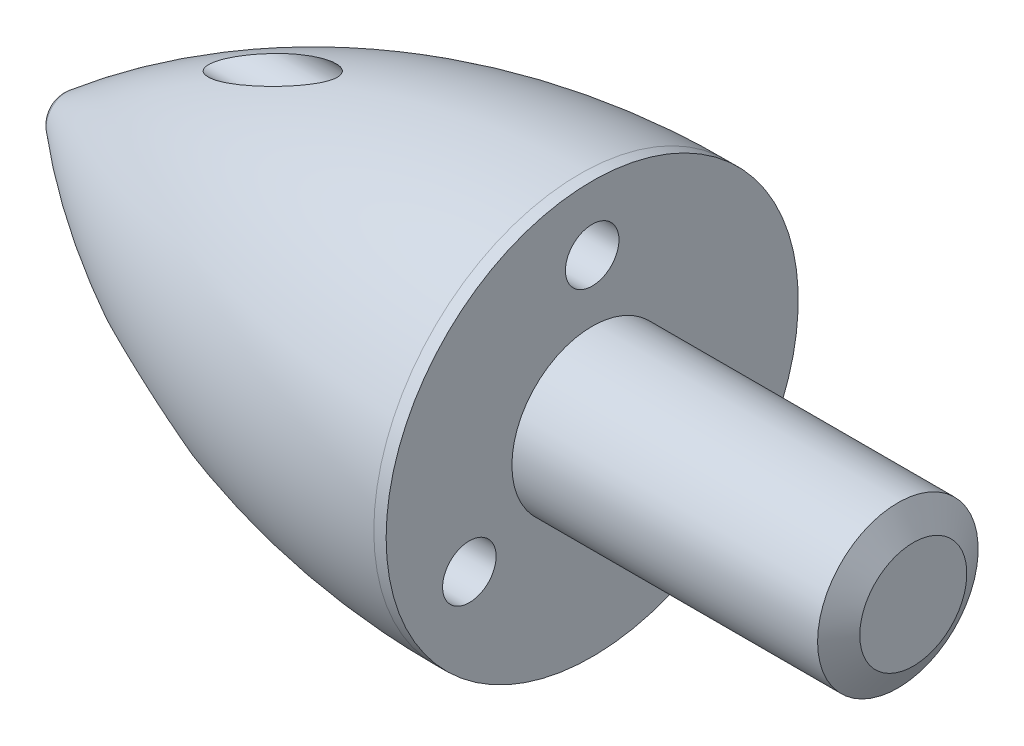
ISO-10303-21;
HEADER;
FILE_DESCRIPTION(('STEP AP214'),'2;1');
FILE_NAME('part.step','',(''),(''),'','','');
FILE_SCHEMA(('AUTOMOTIVE_DESIGN { 1 0 10303 214 1 1 1 1 }'));
ENDSEC;
DATA;
#1=APPLICATION_CONTEXT('core data for automotive mechanical design processes');
#2=APPLICATION_PROTOCOL_DEFINITION('international standard','automotive_design',2000,#1);
#3=PRODUCT_CONTEXT('',#1,'mechanical');
#4=PRODUCT('Part','Part','',(#3));
#5=PRODUCT_RELATED_PRODUCT_CATEGORY('part','',(#4));
#6=PRODUCT_DEFINITION_FORMATION('','',#4);
#7=PRODUCT_DEFINITION_CONTEXT('part definition',#1,'design');
#8=PRODUCT_DEFINITION('design','',#6,#7);
#9=PRODUCT_DEFINITION_SHAPE('','',#8);
#10=(LENGTH_UNIT() NAMED_UNIT(*) SI_UNIT(.MILLI.,.METRE.));
#11=(NAMED_UNIT(*) PLANE_ANGLE_UNIT() SI_UNIT($,.RADIAN.));
#12=(NAMED_UNIT(*) SI_UNIT($,.STERADIAN.) SOLID_ANGLE_UNIT());
#13=UNCERTAINTY_MEASURE_WITH_UNIT(LENGTH_MEASURE(1.E-05),#10,'distance_accuracy_value','');
#14=(GEOMETRIC_REPRESENTATION_CONTEXT(3) GLOBAL_UNCERTAINTY_ASSIGNED_CONTEXT((#13)) GLOBAL_UNIT_ASSIGNED_CONTEXT((#10,
#11,#12)) REPRESENTATION_CONTEXT('',''));
#15=CARTESIAN_POINT('',(0.,0.,0.));
#16=DIRECTION('',(0.,0.,1.));
#17=DIRECTION('',(1.,0.,0.));
#18=AXIS2_PLACEMENT_3D('',#15,#16,#17);
#19=CARTESIAN_POINT('',(-88.99,0.,0.));
#20=DIRECTION('',(-1.,0.,0.));
#21=DIRECTION('',(0.,0.,1.));
#22=AXIS2_PLACEMENT_3D('',#19,#20,#21);
#23=CYLINDRICAL_SURFACE('',#22,3.85);
#24=CARTESIAN_POINT('',(-0.230291266711771,0.,0.));
#25=DIRECTION('',(-1.,0.,0.));
#26=DIRECTION('',(0.,0.,1.));
#27=AXIS2_PLACEMENT_3D('',#24,#25,#26);
#28=CIRCLE('',#27,3.85);
#29=CARTESIAN_POINT('',(-0.230291266711771,0.,3.85));
#30=VERTEX_POINT('',#29);
#31=EDGE_CURVE('E71',#30,#30,#28,.T.);
#32=ORIENTED_EDGE('',*,*,#31,.F.);
#33=EDGE_LOOP('',(#32));
#34=FACE_BOUND('',#33,.T.);
#35=CARTESIAN_POINT('',(0.,0.,0.));
#36=DIRECTION('',(-1.,0.,0.));
#37=DIRECTION('',(0.,0.,1.));
#38=AXIS2_PLACEMENT_3D('',#35,#36,#37);
#39=CIRCLE('',#38,3.85);
#40=CARTESIAN_POINT('',(0.,0.,3.85));
#41=VERTEX_POINT('',#40);
#42=EDGE_CURVE('E10',#41,#41,#39,.T.);
#43=ORIENTED_EDGE('',*,*,#42,.T.);
#44=EDGE_LOOP('',(#43));
#45=FACE_BOUND('',#44,.T.);
#46=ADVANCED_FACE('F41',(#34,#45),#23,.T.);
#47=CARTESIAN_POINT('',(0.,3.85,0.));
#48=DIRECTION('',(-1.,0.,0.));
#49=DIRECTION('',(0.,0.,1.));
#50=AXIS2_PLACEMENT_3D('',#47,#48,#49);
#51=PLANE('',#50);
#52=CARTESIAN_POINT('',(0.,-1.32499999999998,-2.29496732002877));
#53=DIRECTION('',(1.,0.,0.));
#54=DIRECTION('',(0.,0.,-1.));
#55=AXIS2_PLACEMENT_3D('',#52,#53,#54);
#56=CIRCLE('',#55,0.499999999999999);
#57=CARTESIAN_POINT('',(0.,-1.32499999999998,-2.79496732002877));
#58=VERTEX_POINT('',#57);
#59=EDGE_CURVE('E239',#58,#58,#56,.T.);
#60=ORIENTED_EDGE('',*,*,#59,.F.);
#61=EDGE_LOOP('',(#60));
#62=FACE_BOUND('',#61,.T.);
#63=CARTESIAN_POINT('',(0.,-1.32500000000001,2.29496732002876));
#64=DIRECTION('',(1.,0.,0.));
#65=DIRECTION('',(0.,0.,-1.));
#66=AXIS2_PLACEMENT_3D('',#63,#64,#65);
#67=CIRCLE('',#66,0.499999999999999);
#68=CARTESIAN_POINT('',(0.,-1.32500000000001,1.79496732002876));
#69=VERTEX_POINT('',#68);
#70=EDGE_CURVE('E232',#69,#69,#67,.T.);
#71=ORIENTED_EDGE('',*,*,#70,.F.);
#72=EDGE_LOOP('',(#71));
#73=FACE_BOUND('',#72,.T.);
#74=CARTESIAN_POINT('',(0.,2.65,0.));
#75=DIRECTION('',(1.,0.,0.));
#76=DIRECTION('',(0.,0.,-1.));
#77=AXIS2_PLACEMENT_3D('',#74,#75,#76);
#78=CIRCLE('',#77,0.499999999999999);
#79=CARTESIAN_POINT('',(0.,2.65,-0.499999999999999));
#80=VERTEX_POINT('',#79);
#81=EDGE_CURVE('E72',#80,#80,#78,.T.);
#82=ORIENTED_EDGE('',*,*,#81,.F.);
#83=EDGE_LOOP('',(#82));
#84=FACE_BOUND('',#83,.T.);
#85=ORIENTED_EDGE('',*,*,#42,.F.);
#86=EDGE_LOOP('',(#85));
#87=FACE_BOUND('',#86,.T.);
#88=CARTESIAN_POINT('',(0.,0.,0.));
#89=DIRECTION('',(-1.,0.,0.));
#90=DIRECTION('',(0.,0.,1.));
#91=AXIS2_PLACEMENT_3D('',#88,#89,#90);
#92=CIRCLE('',#91,1.5);
#93=CARTESIAN_POINT('',(0.,0.,1.5));
#94=VERTEX_POINT('',#93);
#95=EDGE_CURVE('E54',#94,#94,#92,.T.);
#96=ORIENTED_EDGE('',*,*,#95,.T.);
#97=EDGE_LOOP('',(#96));
#98=FACE_BOUND('',#97,.T.);
#99=ADVANCED_FACE('F98',(#62,#73,#84,#87,#98),#51,.F.);
#100=CARTESIAN_POINT('',(-88.99,0.,0.));
#101=DIRECTION('',(-1.,0.,0.));
#102=DIRECTION('',(0.,0.,1.));
#103=AXIS2_PLACEMENT_3D('',#100,#101,#102);
#104=CYLINDRICAL_SURFACE('',#103,1.5);
#105=ORIENTED_EDGE('',*,*,#95,.F.);
#106=EDGE_LOOP('',(#105));
#107=FACE_BOUND('',#106,.T.);
#108=CARTESIAN_POINT('',(5.71132486540518,0.,0.));
#109=DIRECTION('',(-1.,0.,0.));
#110=DIRECTION('',(0.,0.,1.));
#111=AXIS2_PLACEMENT_3D('',#108,#109,#110);
#112=CIRCLE('',#111,1.5);
#113=CARTESIAN_POINT('',(5.71132486540518,0.,1.5));
#114=VERTEX_POINT('',#113);
#115=EDGE_CURVE('E60',#114,#114,#112,.T.);
#116=ORIENTED_EDGE('',*,*,#115,.T.);
#117=EDGE_LOOP('',(#116));
#118=FACE_BOUND('',#117,.T.);
#119=ADVANCED_FACE('F103',(#107,#118),#104,.T.);
#120=CARTESIAN_POINT('',(6.00000000000001,0.,0.));
#121=DIRECTION('',(-1.,0.,0.));
#122=DIRECTION('',(0.,0.,1.));
#123=AXIS2_PLACEMENT_3D('',#120,#121,#122);
#124=CONICAL_SURFACE('',#123,1.,1.04719755119658);
#125=ORIENTED_EDGE('',*,*,#115,.F.);
#126=EDGE_LOOP('',(#125));
#127=FACE_BOUND('',#126,.T.);
#128=CARTESIAN_POINT('',(6.00000000000001,0.,0.));
#129=DIRECTION('',(-1.,0.,0.));
#130=DIRECTION('',(0.,0.,1.));
#131=AXIS2_PLACEMENT_3D('',#128,#129,#130);
#132=CIRCLE('',#131,1.);
#133=CARTESIAN_POINT('',(6.00000000000001,0.,1.));
#134=VERTEX_POINT('',#133);
#135=EDGE_CURVE('E113',#134,#134,#132,.T.);
#136=ORIENTED_EDGE('',*,*,#135,.T.);
#137=EDGE_LOOP('',(#136));
#138=FACE_BOUND('',#137,.T.);
#139=ADVANCED_FACE('F125',(#127,#138),#124,.T.);
#140=CARTESIAN_POINT('',(6.,1.,0.));
#141=DIRECTION('',(-1.,0.,0.));
#142=DIRECTION('',(0.,0.,1.));
#143=AXIS2_PLACEMENT_3D('',#140,#141,#142);
#144=PLANE('',#143);
#145=ORIENTED_EDGE('',*,*,#135,.F.);
#146=EDGE_LOOP('',(#145));
#147=FACE_BOUND('',#146,.T.);
#148=ADVANCED_FACE('F128',(#147),#144,.F.);
#149=CARTESIAN_POINT('',(-9.5,0.,0.));
#150=DIRECTION('',(-1.,0.,0.));
#151=DIRECTION('',(0.,1.,0.));
#152=AXIS2_PLACEMENT_3D('',#149,#150,#151);
#153=SPHERICAL_SURFACE('',#152,0.499999999999999);
#154=CARTESIAN_POINT('',(-9.81964512873408,0.,0.));
#155=DIRECTION('',(-1.,0.,0.));
#156=DIRECTION('',(0.,0.,1.));
#157=AXIS2_PLACEMENT_3D('',#154,#155,#156);
#158=CIRCLE('',#157,0.384482758620691);
#159=CARTESIAN_POINT('',(-9.81964512873408,0.,0.384482758620691));
#160=VERTEX_POINT('',#159);
#161=EDGE_CURVE('E109',#160,#160,#158,.T.);
#162=ORIENTED_EDGE('',*,*,#161,.T.);
#163=EDGE_LOOP('',(#162));
#164=FACE_BOUND('',#163,.T.);
#165=ADVANCED_FACE('F133',(#164),#153,.T.);
#166=CARTESIAN_POINT('',(-0.230291266711776,0.,0.));
#167=DIRECTION('',(-1.,0.,0.));
#168=DIRECTION('',(0.,0.,1.));
#169=AXIS2_PLACEMENT_3D('',#166,#167,#168);
#170=DEGENERATE_TOROIDAL_SURFACE('',#169,11.15,15.,.F.);
#171=CARTESIAN_POINT('',(-6.9902502362623,-1.34039445682164,-1.7952043654474));
#172=CARTESIAN_POINT('',(-6.96558719905762,-1.36038362523433,-1.79581842645405));
#173=CARTESIAN_POINT('',(-6.94000474732246,-1.37919601587886,-1.79758311368495));
#174=CARTESIAN_POINT('',(-6.88770529061222,-1.4149370417769,-1.80279321339401));
#175=CARTESIAN_POINT('',(-6.86098667671733,-1.43186287383308,-1.8062410870435));
#176=CARTESIAN_POINT('',(-6.77949994157888,-1.48043578823779,-1.81855600504033));
#177=CARTESIAN_POINT('',(-6.72361950207035,-1.50971381935222,-1.82938149597889));
#178=CARTESIAN_POINT('',(-6.60542190944829,-1.56588978951467,-1.85564039391099));
#179=CARTESIAN_POINT('',(-6.54297491961369,-1.5923431211893,-1.87139846294177));
#180=CARTESIAN_POINT('',(-6.41708964208885,-1.64061044733978,-1.90603070995951));
#181=CARTESIAN_POINT('',(-6.35365026066633,-1.66241886948375,-1.92490858300596));
#182=CARTESIAN_POINT('',(-6.22603619438786,-1.70193534753635,-1.96524176381888));
#183=CARTESIAN_POINT('',(-6.16185960881505,-1.71962711669467,-1.98670681574102));
#184=CARTESIAN_POINT('',(-6.03328820612051,-1.75102218353016,-2.03179565340314));
#185=CARTESIAN_POINT('',(-5.96889336560796,-1.76472503909429,-2.05541967805285));
#186=CARTESIAN_POINT('',(-5.83216698502024,-1.78959839336345,-2.10765348843298));
#187=CARTESIAN_POINT('',(-5.75983709563251,-1.80024739402545,-2.13651873160415));
#188=CARTESIAN_POINT('',(-5.61544764739257,-1.81622461259932,-2.19664390120042));
#189=CARTESIAN_POINT('',(-5.54338870088259,-1.82154434718926,-2.22790756063031));
#190=CARTESIAN_POINT('',(-5.40086687242851,-1.82604112510231,-2.2925780397916));
#191=CARTESIAN_POINT('',(-5.33039519935451,-1.82528068305029,-2.32595955628807));
#192=CARTESIAN_POINT('',(-5.22623940385526,-1.81834189723588,-2.37813313496649));
#193=CARTESIAN_POINT('',(-5.1918200650233,-1.81507005153161,-2.39585188073185));
#194=CARTESIAN_POINT('',(-5.12373588346235,-1.80618701374034,-2.43211576063365));
#195=CARTESIAN_POINT('',(-5.09007048912039,-1.80057759502561,-2.45066025881762));
#196=CARTESIAN_POINT('',(-5.03396757737185,-1.78852048620601,-2.48297981013204));
#197=CARTESIAN_POINT('',(-5.01121842127265,-1.78284161274455,-2.49649771995276));
#198=CARTESIAN_POINT('',(-4.96652417283809,-1.76964772582823,-2.52414911973751));
#199=CARTESIAN_POINT('',(-4.94458161626941,-1.76212741094391,-2.53828428845984));
#200=CARTESIAN_POINT('',(-4.90186396798094,-1.7446252460344,-2.56737794715144));
#201=CARTESIAN_POINT('',(-4.88110435721156,-1.73461725164217,-2.58234377826348));
#202=CARTESIAN_POINT('',(-4.84212014692561,-1.71130326823445,-2.61299198812529));
#203=CARTESIAN_POINT('',(-4.82388230904923,-1.69801560835491,-2.62867000224015));
#204=CARTESIAN_POINT('',(-4.80115328928893,-1.67565008750763,-2.65153132572359));
#205=CARTESIAN_POINT('',(-4.79469842870333,-1.66840573575345,-2.6585346493653));
#206=CARTESIAN_POINT('',(-4.78306034316797,-1.65294072932385,-2.67254365001965));
#207=CARTESIAN_POINT('',(-4.77787683577021,-1.64472029210219,-2.6795493261627));
#208=CARTESIAN_POINT('',(-4.76913800377092,-1.6271755037111,-2.69348532520588));
#209=CARTESIAN_POINT('',(-4.76560389802785,-1.61783860911767,-2.70041360347395));
#210=CARTESIAN_POINT('',(-4.76069497603116,-1.59831598748729,-2.71382011833256));
#211=CARTESIAN_POINT('',(-4.75931614008127,-1.58813187802198,-2.72029917112393));
#212=CARTESIAN_POINT('',(-4.75893454771357,-1.56844591012787,-2.73183073370465));
#213=CARTESIAN_POINT('',(-4.75968451468627,-1.55899419784292,-2.73696175797926));
#214=CARTESIAN_POINT('',(-4.76294683308723,-1.54002607909385,-2.74649444951231));
#215=CARTESIAN_POINT('',(-4.76546089029784,-1.53050961884916,-2.75089540573666));
#216=CARTESIAN_POINT('',(-4.77280501703118,-1.50933703155282,-2.75992258235785));
#217=CARTESIAN_POINT('',(-4.77805548712314,-1.4977371522287,-2.76433279071632));
#218=CARTESIAN_POINT('',(-4.7903025944087,-1.47511420020739,-2.77205153464643));
#219=CARTESIAN_POINT('',(-4.79730279741862,-1.46409236169527,-2.77535778790556));
#220=CARTESIAN_POINT('',(-4.81776696175753,-1.43535648528618,-2.78299520776722));
#221=CARTESIAN_POINT('',(-4.83237054306251,-1.41823910459267,-2.78647327510294));
#222=CARTESIAN_POINT('',(-4.86358615311804,-1.38565357332615,-2.79154893477812));
#223=CARTESIAN_POINT('',(-4.88020432432519,-1.37019075170319,-2.79314060806359));
#224=CARTESIAN_POINT('',(-4.92041808476221,-1.33569065440086,-2.79524385635625));
#225=CARTESIAN_POINT('',(-4.94449052540682,-1.31718407120605,-2.79521724806634));
#226=CARTESIAN_POINT('',(-4.99390627235901,-1.28201591211874,-2.79342623497164));
#227=CARTESIAN_POINT('',(-5.01925192270101,-1.26535793501676,-2.79165850443961));
#228=CARTESIAN_POINT('',(-5.07082093331497,-1.23348381777296,-2.78678571345923));
#229=CARTESIAN_POINT('',(-5.09704700365921,-1.21827281406298,-2.78367609106586));
#230=CARTESIAN_POINT('',(-5.15004321691467,-1.18909915630937,-2.77637794347792));
#231=CARTESIAN_POINT('',(-5.17681359937515,-1.17513706716971,-2.77218893335019));
#232=CARTESIAN_POINT('',(-5.26127281021758,-1.13306289328547,-2.75765926124137));
#233=CARTESIAN_POINT('',(-5.31963164559779,-1.10683934294568,-2.7457256862469));
#234=CARTESIAN_POINT('',(-5.43725177985941,-1.0582225595486,-2.71875742606154));
#235=CARTESIAN_POINT('',(-5.49651403925084,-1.03583376531049,-2.7037191909499));
#236=CARTESIAN_POINT('',(-5.61555639520755,-0.994433494652384,-2.67102837661943));
#237=CARTESIAN_POINT('',(-5.67533692143265,-0.975425172859961,-2.65337338333534));
#238=CARTESIAN_POINT('',(-5.79512721765835,-0.940607724002333,-2.61574627649365));
#239=CARTESIAN_POINT('',(-5.85513708867339,-0.924800226762468,-2.59577299058861));
#240=CARTESIAN_POINT('',(-5.98632615346709,-0.893741426592841,-2.54976909767094));
#241=CARTESIAN_POINT('',(-6.05750804975429,-0.87913969580391,-2.5233026636899));
#242=CARTESIAN_POINT('',(-6.19952176191692,-0.854720518117957,-2.4674909202409));
#243=CARTESIAN_POINT('',(-6.27035373522756,-0.84490067947133,-2.43814705881189));
#244=CARTESIAN_POINT('',(-6.41108970417126,-0.830702038448782,-2.37662067206324));
#245=CARTESIAN_POINT('',(-6.48099602323806,-0.826305004376178,-2.34444805020978));
#246=CARTESIAN_POINT('',(-6.58471382953764,-0.824719538039288,-2.29384745249328));
#247=CARTESIAN_POINT('',(-6.61907115660233,-0.825023990402939,-2.27660392939082));
#248=CARTESIAN_POINT('',(-6.68726700085834,-0.82757622123479,-2.24126364126386));
#249=CARTESIAN_POINT('',(-6.7211056855714,-0.829823358152856,-2.22316715978461));
#250=CARTESIAN_POINT('',(-6.79492347293701,-0.837347814407885,-2.18220547383247));
#251=CARTESIAN_POINT('',(-6.83473227221115,-0.843153789685599,-2.15912559680092));
#252=CARTESIAN_POINT('',(-6.91243207440207,-0.859228769196036,-2.11140154889956));
#253=CARTESIAN_POINT('',(-6.95032854290084,-0.869484143095867,-2.0867623502145));
#254=CARTESIAN_POINT('',(-7.00359346813844,-0.889492979282258,-2.04895522851827));
#255=CARTESIAN_POINT('',(-7.02040742658153,-0.896721244995779,-2.03650299346146));
#256=CARTESIAN_POINT('',(-7.05276336092889,-0.913089981835273,-2.01113760411825));
#257=CARTESIAN_POINT('',(-7.06830477673415,-0.92223128874282,-1.99822425042731));
#258=CARTESIAN_POINT('',(-7.09459000012441,-0.940952434166425,-1.97451479763526));
#259=CARTESIAN_POINT('',(-7.10568358767266,-0.950116425816138,-1.96378439524205));
#260=CARTESIAN_POINT('',(-7.12587239919114,-0.97033878998775,-1.94221719680996));
#261=CARTESIAN_POINT('',(-7.13497280655334,-0.981392112466565,-1.93138075517931));
#262=CARTESIAN_POINT('',(-7.14776100723135,-1.00168713909029,-1.91340682957024));
#263=CARTESIAN_POINT('',(-7.15224774678138,-1.01036205667838,-1.90620436764947));
#264=CARTESIAN_POINT('',(-7.15951279314594,-1.02863067299599,-1.89210528747403));
#265=CARTESIAN_POINT('',(-7.16229316973612,-1.03822324223859,-1.88520830814078));
#266=CARTESIAN_POINT('',(-7.16587026269441,-1.05821564045521,-1.87191777501592));
#267=CARTESIAN_POINT('',(-7.16665260251996,-1.06862076789976,-1.86552818855537));
#268=CARTESIAN_POINT('',(-7.16609251934828,-1.08983087275235,-1.85355617135454));
#269=CARTESIAN_POINT('',(-7.1647498674711,-1.10063589310988,-1.84797382763196));
#270=CARTESIAN_POINT('',(-7.16031732478813,-1.12127773898021,-1.83822238716792));
#271=CARTESIAN_POINT('',(-7.15739666287564,-1.13111363713112,-1.83397109070129));
#272=CARTESIAN_POINT('',(-7.15018196335056,-1.1505833784048,-1.82625772931249));
#273=CARTESIAN_POINT('',(-7.14588714587506,-1.16021710347375,-1.82279611446721));
#274=CARTESIAN_POINT('',(-7.13303734988624,-1.18531243861877,-1.8145945910512));
#275=CARTESIAN_POINT('',(-7.1235283032991,-1.20048951662953,-1.81048748253507));
#276=CARTESIAN_POINT('',(-7.10250182736657,-1.2297624767135,-1.80389048461833));
#277=CARTESIAN_POINT('',(-7.09097837526447,-1.24385492859101,-1.80140555385759));
#278=CARTESIAN_POINT('',(-7.06530409021152,-1.27243668897334,-1.79750731558232));
#279=CARTESIAN_POINT('',(-7.05100418908927,-1.28680910304148,-1.79623590203023));
#280=CARTESIAN_POINT('',(-7.02134359967527,-1.31441137075146,-1.79488916699191));
#281=CARTESIAN_POINT('',(-7.00598400945372,-1.32764237606694,-1.79481262551188));
#282=CARTESIAN_POINT('',(-6.9902502362623,-1.34039445682164,-1.7952043654474));
#283=B_SPLINE_CURVE_WITH_KNOTS('',3,(#171,#172,#173,#174,#175,#176,#177,#178,#179,#180,#181,
#182,#183,#184,#185,#186,#187,#188,#189,#190,#191,#192,#193,#194,#195,#196,#197,#198,#199,#200,
#201,#202,#203,#204,#205,#206,#207,#208,#209,#210,#211,#212,#213,#214,#215,#216,#217,#218,#219,
#220,#221,#222,#223,#224,#225,#226,#227,#228,#229,#230,#231,#232,#233,#234,#235,#236,#237,#238,
#239,#240,#241,#242,#243,#244,#245,#246,#247,#248,#249,#250,#251,#252,#253,#254,#255,#256,#257,
#258,#259,#260,#261,#262,#263,#264,#265,#266,#267,#268,#269,#270,#271,#272,#273,#274,#275,#276,
#277,#278,#279,#280,#281,#282),.UNSPECIFIED.,.T.,.F.,(4,2,2,2,2,2,2,2,2,2,2,2,2,2,2,2,2,2,2,2,2,
2,2,2,2,2,2,2,2,2,2,2,2,2,2,2,2,2,2,2,2,2,2,2,2,2,2,2,2,2,2,2,2,2,2,4),(0.,0.0952279411587852,
0.190595544490516,0.38214450937825,0.59076322101306,0.799630812682086,1.00931120834467,
1.21901483518783,1.45460809069119,1.69057577912541,1.92412045980749,2.04061173094802,
2.15701478777955,2.23815251781934,2.31952664446328,2.40179508694246,2.48361377075538,
2.51943061362236,2.55523949207942,2.59149713547741,2.62768707535351,2.65985083176141,
2.69204573176198,2.73224469378986,2.77252625572897,2.84044418410363,2.90857466320929,
2.99945658242129,3.09051243300506,3.18188030974095,3.27328930682791,3.46825162451824,
3.66343811247647,3.85880580176294,4.05427272138876,4.28607351781327,4.51775825549994,
4.74866191701306,4.86394330432854,4.97918663577448,5.11815902489171,5.25670865778657,
5.32303362610536,5.38938763161631,5.44309162017069,5.49665424462865,5.53292863944118,
5.56915894690354,5.60564921836923,5.64214342041967,5.67533293313818,5.70854131513078,
5.76334708401278,5.81831960718976,5.87913232360687,5.93988294467774),.UNSPECIFIED.);
#284=CARTESIAN_POINT('',(-6.9902502362623,-1.34039445682164,-1.7952043654474));
#285=VERTEX_POINT('',#284);
#286=EDGE_CURVE('E44',#285,#285,#283,.T.);
#287=ORIENTED_EDGE('',*,*,#286,.T.);
#288=EDGE_LOOP('',(#287));
#289=FACE_BOUND('',#288,.T.);
#290=CARTESIAN_POINT('',(-6.9902502362625,-1.3403944568215,1.79520436544738));
#291=CARTESIAN_POINT('',(-7.00849663339533,-1.32560783657686,1.79474897702568));
#292=CARTESIAN_POINT('',(-7.02624116970375,-1.31017491121447,1.79492394942251));
#293=CARTESIAN_POINT('',(-7.06019813916927,-1.2777652553229,1.79693825907785));
#294=CARTESIAN_POINT('',(-7.07641169570372,-1.26078967497181,1.79877636534244));
#295=CARTESIAN_POINT('',(-7.10181214612389,-1.23046433843644,1.80382348318124));
#296=CARTESIAN_POINT('',(-7.11164352001215,-1.21756501940398,1.80645188954956));
#297=CARTESIAN_POINT('',(-7.12951882683886,-1.19090088193405,1.81309041639155));
#298=CARTESIAN_POINT('',(-7.13756618199776,-1.17713778671018,1.81709785314206));
#299=CARTESIAN_POINT('',(-7.14933732455247,-1.15262758561851,1.82549040184998));
#300=CARTESIAN_POINT('',(-7.15364148229815,-1.14203497549759,1.8295015171297));
#301=CARTESIAN_POINT('',(-7.16050842518166,-1.12068569886764,1.83847069138446));
#302=CARTESIAN_POINT('',(-7.16307338620633,-1.10992925462935,1.84342755715197));
#303=CARTESIAN_POINT('',(-7.16620106148368,-1.08849602595907,1.85427377517823));
#304=CARTESIAN_POINT('',(-7.16675048548883,-1.07782023188314,1.86016905046219));
#305=CARTESIAN_POINT('',(-7.16573991850303,-1.05700355075147,1.87268130836463));
#306=CARTESIAN_POINT('',(-7.16417930004068,-1.04686282374257,1.87929850512564));
#307=CARTESIAN_POINT('',(-7.15935913507489,-1.02827033551341,1.89238855038079));
#308=CARTESIAN_POINT('',(-7.15626022025035,-1.01974843090209,1.89882335256105));
#309=CARTESIAN_POINT('',(-7.14871804614668,-1.00349942962767,1.91189260460461));
#310=CARTESIAN_POINT('',(-7.14427429828122,-0.995772623198192,1.91852712623705));
#311=CARTESIAN_POINT('',(-7.13088487531571,-0.976083365382857,1.93644668312572));
#312=CARTESIAN_POINT('',(-7.12094386537484,-0.964858546837364,1.94779483736307));
#313=CARTESIAN_POINT('',(-7.09903421738086,-0.94440908245929,1.97033956509101));
#314=CARTESIAN_POINT('',(-7.08705867408631,-0.935191500787745,1.98153547723933));
#315=CARTESIAN_POINT('',(-7.05073864563493,-0.911061900828968,2.01330012693747));
#316=CARTESIAN_POINT('',(-7.02473131443232,-0.898213765560741,2.03350868841118));
#317=CARTESIAN_POINT('',(-6.97038493670371,-0.876500062115839,2.07282063992027));
#318=CARTESIAN_POINT('',(-6.94203983564577,-0.867645245325762,2.09192092719533));
#319=CARTESIAN_POINT('',(-6.88000520967575,-0.851863420027698,2.13168967185507));
#320=CARTESIAN_POINT('',(-6.84611596807839,-0.845367543019223,2.15221377973628));
#321=CARTESIAN_POINT('',(-6.77726539250055,-0.835247922818004,2.19217326452104));
#322=CARTESIAN_POINT('',(-6.74230284254345,-0.831627572244047,2.21160733032758));
#323=CARTESIAN_POINT('',(-6.67162259997377,-0.826700754189664,2.2495356478657));
#324=CARTESIAN_POINT('',(-6.63590344407878,-0.825399283455122,2.26802778689511));
#325=CARTESIAN_POINT('',(-6.56399294548296,-0.824758979896689,2.30411636464776));
#326=CARTESIAN_POINT('',(-6.52780144478064,-0.825420821479818,2.3217124934756));
#327=CARTESIAN_POINT('',(-6.41581013854869,-0.830079081285553,2.37462989291243));
#328=CARTESIAN_POINT('',(-6.3394621770349,-0.836905613145773,2.40856227869688));
#329=CARTESIAN_POINT('',(-6.1860706734972,-0.856578595684649,2.47305289251));
#330=CARTESIAN_POINT('',(-6.10902645455341,-0.869431707440346,2.50360734066604));
#331=CARTESIAN_POINT('',(-5.9547849663506,-0.900546845257008,2.56126124434478));
#332=CARTESIAN_POINT('',(-5.87758780451697,-0.918805893853386,2.58836259003392));
#333=CARTESIAN_POINT('',(-5.72347834209977,-0.960559075024746,2.63884879557685));
#334=CARTESIAN_POINT('',(-5.64656585061592,-0.984048586449097,2.66223690504625));
#335=CARTESIAN_POINT('',(-5.49198983678003,-1.03706650949066,2.7051965885641));
#336=CARTESIAN_POINT('',(-5.41433883663104,-1.06669883051651,2.72468934461416));
#337=CARTESIAN_POINT('',(-5.29919620751462,-1.11631518093649,2.74970860852347));
#338=CARTESIAN_POINT('',(-5.2610416139281,-1.13371315940882,2.75734446603404));
#339=CARTESIAN_POINT('',(-5.18542168157325,-1.17053505202781,2.77091618262995));
#340=CARTESIAN_POINT('',(-5.14795593270425,-1.18995771160369,2.77685308601077));
#341=CARTESIAN_POINT('',(-5.0740101136989,-1.23136418508854,2.78658365118497));
#342=CARTESIAN_POINT('',(-5.03753357261738,-1.25335597836641,2.7903704094181));
#343=CARTESIAN_POINT('',(-4.96660868138604,-1.3005932212663,2.79494063360801));
#344=CARTESIAN_POINT('',(-4.93215245365358,-1.32582461235029,2.79573665112765));
#345=CARTESIAN_POINT('',(-4.88672744641381,-1.3645241207536,2.79352411802361));
#346=CARTESIAN_POINT('',(-4.87400744475424,-1.37603233709025,2.79250161249465));
#347=CARTESIAN_POINT('',(-4.84953689360592,-1.39998688361826,2.78946082962886));
#348=CARTESIAN_POINT('',(-4.83778839256887,-1.4124350952229,2.78744050786261));
#349=CARTESIAN_POINT('',(-4.81563254970131,-1.43854229480225,2.78209003492661));
#350=CARTESIAN_POINT('',(-4.80524553024619,-1.45221539938632,2.7787425120907));
#351=CARTESIAN_POINT('',(-4.7868927326291,-1.48062707018947,2.77035851601218));
#352=CARTESIAN_POINT('',(-4.77891595369331,-1.49536040349917,2.76532994405565));
#353=CARTESIAN_POINT('',(-4.76904058473245,-1.51952555412795,2.75567929004476));
#354=CARTESIAN_POINT('',(-4.76598637538556,-1.52873483765147,2.75169125348675));
#355=CARTESIAN_POINT('',(-4.76146376737091,-1.54720374175922,2.74299546731853));
#356=CARTESIAN_POINT('',(-4.75999358889289,-1.55646329407502,2.73828853226615));
#357=CARTESIAN_POINT('',(-4.75879730257043,-1.57478856286797,2.72822847753268));
#358=CARTESIAN_POINT('',(-4.75907752821371,-1.58385345621648,2.72287308010541));
#359=CARTESIAN_POINT('',(-4.76136284575717,-1.60147204558046,2.71170740740911));
#360=CARTESIAN_POINT('',(-4.7633692857742,-1.61002533646597,2.70589677984484));
#361=CARTESIAN_POINT('',(-4.76949308299439,-1.62819260768292,2.69274325847166));
#362=CARTESIAN_POINT('',(-4.77397170697236,-1.63763890939932,2.68533965331003));
#363=CARTESIAN_POINT('',(-4.78465437184088,-1.65540073059661,2.67042788249889));
#364=CARTESIAN_POINT('',(-4.79086193632412,-1.66371388863818,2.66291953338328));
#365=CARTESIAN_POINT('',(-4.80879742346578,-1.68414003220801,2.64328747009988));
#366=CARTESIAN_POINT('',(-4.82155167379486,-1.6953833329495,2.63121011156624));
#367=CARTESIAN_POINT('',(-4.84902017572482,-1.71564314097932,2.60744535322517));
#368=CARTESIAN_POINT('',(-4.86374001314439,-1.72465308497745,2.5957591880832));
#369=CARTESIAN_POINT('',(-4.89526195920861,-1.74139197716212,2.57216423903457));
#370=CARTESIAN_POINT('',(-4.91213463090075,-1.74902030863643,2.56027993365129));
#371=CARTESIAN_POINT('',(-4.94677740514509,-1.76276046616321,2.53693559319341));
#372=CARTESIAN_POINT('',(-4.96454848566075,-1.76887059485218,2.52547604506627));
#373=CARTESIAN_POINT('',(-5.01882007800939,-1.78538926986873,2.49163085848891));
#374=CARTESIAN_POINT('',(-5.05622787245092,-1.79396206352924,2.46981509510305));
#375=CARTESIAN_POINT('',(-5.15023888082027,-1.81089997277546,2.41735582817312));
#376=CARTESIAN_POINT('',(-5.20756262672903,-1.81725417281295,2.38741010277357));
#377=CARTESIAN_POINT('',(-5.32358499735733,-1.82465728930518,2.3294561085171));
#378=CARTESIAN_POINT('',(-5.38228601853948,-1.82569614361499,2.30145161321721));
#379=CARTESIAN_POINT('',(-5.50068380344873,-1.82344403912036,2.24702330359969));
#380=CARTESIAN_POINT('',(-5.56038412740267,-1.82013087523057,2.22060832045208));
#381=CARTESIAN_POINT('',(-5.6800852760821,-1.80968766660575,2.16943727973716));
#382=CARTESIAN_POINT('',(-5.74008579407898,-1.80256094606461,2.14467979847624));
#383=CARTESIAN_POINT('',(-5.8778192060199,-1.78216037109869,2.0897934346323));
#384=CARTESIAN_POINT('',(-5.95559844133075,-1.76769742515246,2.06021522438549));
#385=CARTESIAN_POINT('',(-6.11104849101005,-1.73298562227344,2.00404047120932));
#386=CARTESIAN_POINT('',(-6.18871906006961,-1.71272978085452,1.97744758190301));
#387=CARTESIAN_POINT('',(-6.34303832401381,-1.66625998263844,1.92796247386081));
#388=CARTESIAN_POINT('',(-6.41969019865571,-1.64007663314077,1.90505224367498));
#389=CARTESIAN_POINT('',(-6.53351893104879,-1.59565903993215,1.87417569570957));
#390=CARTESIAN_POINT('',(-6.5712391321419,-1.58001137370589,1.86447166864883));
#391=CARTESIAN_POINT('',(-6.64614895328259,-1.54678284179604,1.84644802464847));
#392=CARTESIAN_POINT('',(-6.68333865536247,-1.5292022787433,1.83812819149883));
#393=CARTESIAN_POINT('',(-6.76732281710936,-1.4865471787812,1.82107437664087));
#394=CARTESIAN_POINT('',(-6.81387955193215,-1.46075504060487,1.81288100894017));
#395=CARTESIAN_POINT('',(-6.88186816123628,-1.41855899930821,1.80359101811));
#396=CARTESIAN_POINT('',(-6.90419692868397,-1.40392916930323,1.80099572181212));
#397=CARTESIAN_POINT('',(-6.94798421557099,-1.37327698451575,1.79706261770822));
#398=CARTESIAN_POINT('',(-6.96944351777441,-1.3572559250106,1.79572365364571));
#399=CARTESIAN_POINT('',(-6.9902502362625,-1.3403944568215,1.79520436544738));
#400=B_SPLINE_CURVE_WITH_KNOTS('',3,(#290,#291,#292,#293,#294,#295,#296,#297,#298,#299,#300,
#301,#302,#303,#304,#305,#306,#307,#308,#309,#310,#311,#312,#313,#314,#315,#316,#317,#318,#319,
#320,#321,#322,#323,#324,#325,#326,#327,#328,#329,#330,#331,#332,#333,#334,#335,#336,#337,#338,
#339,#340,#341,#342,#343,#344,#345,#346,#347,#348,#349,#350,#351,#352,#353,#354,#355,#356,#357,
#358,#359,#360,#361,#362,#363,#364,#365,#366,#367,#368,#369,#370,#371,#372,#373,#374,#375,#376,
#377,#378,#379,#380,#381,#382,#383,#384,#385,#386,#387,#388,#389,#390,#391,#392,#393,#394,#395,
#396,#397,#398,#399),.UNSPECIFIED.,.T.,.F.,(4,2,2,2,2,2,2,2,2,2,2,2,2,2,2,2,2,2,2,2,2,2,2,2,2,2,
2,2,2,2,2,2,2,2,2,2,2,2,2,2,2,2,2,2,2,2,2,2,2,2,2,2,2,2,4),(0.,0.0704466637013159,
0.140841227844685,0.190006457527075,0.239076543128713,0.275291072710156,0.311460210742932,
0.347867420049949,0.384285458289754,0.417516419754665,0.450759468760527,0.506844179479158,
0.563123191194062,0.668588607039992,0.774336301232964,0.894591476053185,1.01498832108689,
1.13564428614107,1.25634170188584,1.50743940120442,1.7588152911689,2.01005298587441,
2.26106958487757,2.51674111414647,2.64454980521029,2.77227976657964,2.90041754990186,
3.02801695902881,3.07950989142715,3.13110876832714,3.18340658035445,3.23546195902187,
3.26680968466924,3.29812215129778,3.32954798130121,3.36099837614943,3.39921482159854,
3.43750972962629,3.49972296796783,3.56211692416901,3.62802197250399,3.69400037501608,
3.82615694824797,4.02073933421175,4.21568993586142,4.41163909822372,4.60741773356434,
4.86053995940025,5.11396867039524,5.36611747419235,5.49198065374538,5.61782415507077,
5.77903108015823,5.85943684283993,5.93976853185165),.UNSPECIFIED.);
#401=CARTESIAN_POINT('',(-6.9902502362625,-1.3403944568215,1.79520436544738));
#402=VERTEX_POINT('',#401);
#403=EDGE_CURVE('E73',#402,#402,#400,.T.);
#404=ORIENTED_EDGE('',*,*,#403,.T.);
#405=EDGE_LOOP('',(#404));
#406=FACE_BOUND('',#405,.T.);
#407=CARTESIAN_POINT('',(-7.1522146020418,2.15601593691178,-0.0773328739780852));
#408=CARTESIAN_POINT('',(-7.14588867319225,2.15869438585881,-0.0944414205181238));
#409=CARTESIAN_POINT('',(-7.13770240971409,2.16216327180085,-0.110749113170298));
#410=CARTESIAN_POINT('',(-7.11878312242559,2.17018631256565,-0.141545761273718));
#411=CARTESIAN_POINT('',(-7.10803514789563,2.1747468391453,-0.156023246127598));
#412=CARTESIAN_POINT('',(-7.07795883353544,2.18752167041952,-0.191448078087515));
#413=CARTESIAN_POINT('',(-7.05734424180882,2.19628952933183,-0.211083929699949));
#414=CARTESIAN_POINT('',(-7.01386863186513,2.21480970391011,-0.247015866072201));
#415=CARTESIAN_POINT('',(-6.99100443400508,2.22456341354595,-0.263307120205895));
#416=CARTESIAN_POINT('',(-6.94171245033554,2.24562001236266,-0.29473160911617));
#417=CARTESIAN_POINT('',(-6.91515154771203,2.25698240548278,-0.30961300922278));
#418=CARTESIAN_POINT('',(-6.86100212298028,2.28017494444904,-0.336971159719512));
#419=CARTESIAN_POINT('',(-6.8334124702405,2.2920056058718,-0.349445165443));
#420=CARTESIAN_POINT('',(-6.74952506620749,2.32800952150189,-0.383975816303918));
#421=CARTESIAN_POINT('',(-6.69221538390377,2.3526491622407,-0.403079324820035));
#422=CARTESIAN_POINT('',(-6.56923235558538,2.40554656564326,-0.437432173892624));
#423=CARTESIAN_POINT('',(-6.50339155053668,2.4338790408398,-0.451927104774327));
#424=CARTESIAN_POINT('',(-6.37075776195436,2.49087945012646,-0.474999972366093));
#425=CARTESIAN_POINT('',(-6.30396377951037,2.51954772947897,-0.483571152330237));
#426=CARTESIAN_POINT('',(-6.16992559869631,2.5769043362984,-0.495493829282963));
#427=CARTESIAN_POINT('',(-6.10268134042965,2.60559266595886,-0.49884461741277));
#428=CARTESIAN_POINT('',(-5.96802019812017,2.66277584915095,-0.500654982033837));
#429=CARTESIAN_POINT('',(-5.90060326592699,2.69127063816577,-0.499113000693604));
#430=CARTESIAN_POINT('',(-5.77862877254628,2.74250495364013,-0.491913528562669));
#431=CARTESIAN_POINT('',(-5.72404985865544,2.76531401741639,-0.487089273174821));
#432=CARTESIAN_POINT('',(-5.61515002764937,2.81055033831172,-0.474107302445317));
#433=CARTESIAN_POINT('',(-5.56082901198116,2.83297775146196,-0.465950985209164));
#434=CARTESIAN_POINT('',(-5.45258205732557,2.87735923474378,-0.44598298123086));
#435=CARTESIAN_POINT('',(-5.39865668651253,2.89931268868528,-0.434166810395576));
#436=CARTESIAN_POINT('',(-5.29165282345966,2.94253441551709,-0.406310261380264));
#437=CARTESIAN_POINT('',(-5.2385735341912,2.96380335517212,-0.390274142658665));
#438=CARTESIAN_POINT('',(-5.15995671612096,2.99503789609178,-0.362139030047597));
#439=CARTESIAN_POINT('',(-5.13384409999959,3.00536681567073,-0.352045352780457));
#440=CARTESIAN_POINT('',(-5.08218033274424,3.02571188626792,-0.330247789566152));
#441=CARTESIAN_POINT('',(-5.05662892764298,3.03572817966187,-0.318544650123961));
#442=CARTESIAN_POINT('',(-5.00646128230938,3.0553053816295,-0.293228108002057));
#443=CARTESIAN_POINT('',(-4.98184135543028,3.06486813444056,-0.279623526553604));
#444=CARTESIAN_POINT('',(-4.93392048801927,3.08339779381432,-0.249946968267126));
#445=CARTESIAN_POINT('',(-4.91061692168084,3.09236589325979,-0.233880159302817));
#446=CARTESIAN_POINT('',(-4.87285711025662,3.10683580122253,-0.203693910582584));
#447=CARTESIAN_POINT('',(-4.85782876154312,3.11257604354061,-0.190413288378338));
#448=CARTESIAN_POINT('',(-4.82956209864568,3.12334301032429,-0.161801878809865));
#449=CARTESIAN_POINT('',(-4.81631913140863,3.12837159129135,-0.146476636243849));
#450=CARTESIAN_POINT('',(-4.79748887578036,3.13550588108739,-0.11995817987888));
#451=CARTESIAN_POINT('',(-4.79095161507249,3.13797862676192,-0.109545897175171));
#452=CARTESIAN_POINT('',(-4.77936954531799,3.14235483365013,-0.0878022911613649));
#453=CARTESIAN_POINT('',(-4.77432276450513,3.14425904701603,-0.076472207546941));
#454=CARTESIAN_POINT('',(-4.76687707233901,3.14706646942955,-0.0549722651612094));
#455=CARTESIAN_POINT('',(-4.76417721594415,3.14808355012949,-0.0449232781731276));
#456=CARTESIAN_POINT('',(-4.76040332643279,3.14950489961962,-0.0244833908479966));
#457=CARTESIAN_POINT('',(-4.75932756742649,3.14990981893981,-0.0140928654746952));
#458=CARTESIAN_POINT('',(-4.7589200389838,3.15006323685004,0.00675201869782045));
#459=CARTESIAN_POINT('',(-4.75959222117652,3.14981024808518,0.0172064687353622));
#460=CARTESIAN_POINT('',(-4.7626102966612,3.14867374992683,0.0378363002453574));
#461=CARTESIAN_POINT('',(-4.76495775832464,3.14778964969605,0.0480114109278848));
#462=CARTESIAN_POINT('',(-4.77191607128676,3.14516682431693,0.0704985224595132));
#463=CARTESIAN_POINT('',(-4.77696443799716,3.14326273693123,0.0826539362683864));
#464=CARTESIAN_POINT('',(-4.78880268511178,3.13879116453975,0.105946534362249));
#465=CARTESIAN_POINT('',(-4.79559624928518,3.13622227618378,0.117081496381843));
#466=CARTESIAN_POINT('',(-4.81539219865136,3.12872371524153,0.145472441510403));
#467=CARTESIAN_POINT('',(-4.82950458828868,3.12336559383647,0.161830189317846));
#468=CARTESIAN_POINT('',(-4.85972513132286,3.11185297292853,0.192240756252981));
#469=CARTESIAN_POINT('',(-4.87583924993316,3.10569609055145,0.206286381324502));
#470=CARTESIAN_POINT('',(-4.91465584712709,3.09081310987592,0.236763965571349));
#471=CARTESIAN_POINT('',(-4.93781328215716,3.08189651759083,0.252515559257779));
#472=CARTESIAN_POINT('',(-4.98538532166335,3.06349310626167,0.281634583511991));
#473=CARTESIAN_POINT('',(-5.00980222408028,3.05400523922474,0.294997442110007));
#474=CARTESIAN_POINT('',(-5.08438832190538,3.02488753460352,0.332367514496241));
#475=CARTESIAN_POINT('',(-5.13573464296564,3.00466417133843,0.353546127574241));
#476=CARTESIAN_POINT('',(-5.24329668671913,2.96192373835835,0.39188172892174));
#477=CARTESIAN_POINT('',(-5.29960897964816,2.93934360612611,0.408676999724446));
#478=CARTESIAN_POINT('',(-5.41317870385784,2.89341885935434,0.437587824999276));
#479=CARTESIAN_POINT('',(-5.47043713307488,2.87007340818135,0.449698059358362));
#480=CARTESIAN_POINT('',(-5.5854275030383,2.82284172841711,0.469876676802905));
#481=CARTESIAN_POINT('',(-5.64315945314756,2.7989554891164,0.47794497977093));
#482=CARTESIAN_POINT('',(-5.75887875923341,2.75077604340685,0.490370135027863));
#483=CARTESIAN_POINT('',(-5.81686622257361,2.72648265085493,0.494725239750311));
#484=CARTESIAN_POINT('',(-5.94439108357194,2.67278267728677,0.500347801730805));
#485=CARTESIAN_POINT('',(-6.01393932575465,2.64331715018805,0.500832029123923));
#486=CARTESIAN_POINT('',(-6.15278017089401,2.58423390556103,0.496540093211144));
#487=CARTESIAN_POINT('',(-6.22207286627974,2.55461625477067,0.491766068280707));
#488=CARTESIAN_POINT('',(-6.360003262248,2.49550579337204,0.476511272411766));
#489=CARTESIAN_POINT('',(-6.42864162063003,2.46601287880362,0.466037026696652));
#490=CARTESIAN_POINT('',(-6.56471344949397,2.40749878347131,0.43845602626209));
#491=CARTESIAN_POINT('',(-6.6321485249468,2.37847697985923,0.421358925249239));
#492=CARTESIAN_POINT('',(-6.74746688248288,2.32890029393363,0.384174336963857));
#493=CARTESIAN_POINT('',(-6.79585698535967,2.30811358670021,0.366033878567937));
#494=CARTESIAN_POINT('',(-6.86658556055534,2.27778333912948,0.334165211396831));
#495=CARTESIAN_POINT('',(-6.88980250140331,2.26783617747026,0.32279655301021));
#496=CARTESIAN_POINT('',(-6.93537605103877,2.24833114080044,0.29817553117085));
#497=CARTESIAN_POINT('',(-6.95773265772783,2.23877326673935,0.284923163123921));
#498=CARTESIAN_POINT('',(-7.01027756933193,2.21633765986611,0.250070413046978));
#499=CARTESIAN_POINT('',(-7.03986372165964,2.20372912537287,0.22728847438442));
#500=CARTESIAN_POINT('',(-7.08040371538536,2.18648408145422,0.188034206380033));
#501=CARTESIAN_POINT('',(-7.09333815793568,2.18098788281918,0.174010156044964));
#502=CARTESIAN_POINT('',(-7.11707540217065,2.17091006606184,0.143956046749812));
#503=CARTESIAN_POINT('',(-7.12788440867092,2.16632578529489,0.12793205707413));
#504=CARTESIAN_POINT('',(-7.14273114706388,2.16003324706493,0.100251734492684));
#505=CARTESIAN_POINT('',(-7.14778248239799,2.15789350666651,0.0892422708496041));
#506=CARTESIAN_POINT('',(-7.15624783331475,2.15430867345261,0.0664993996079373));
#507=CARTESIAN_POINT('',(-7.15966368712165,2.15286280074977,0.054766821592453));
#508=CARTESIAN_POINT('',(-7.16454469119284,2.15079704662609,0.0307101089452377));
#509=CARTESIAN_POINT('',(-7.16599219291001,2.15018463813318,0.0183816356175697));
#510=CARTESIAN_POINT('',(-7.16669373580444,2.14988776243384,-0.00634850374973929));
#511=CARTESIAN_POINT('',(-7.16594898311764,2.15020278497283,-0.0187501257972763));
#512=CARTESIAN_POINT('',(-7.16299743391562,2.15145192541628,-0.0389070101805175));
#513=CARTESIAN_POINT('',(-7.16139122944531,2.15213176682472,-0.0467740761433753));
#514=CARTESIAN_POINT('',(-7.15737914695263,2.15382975164113,-0.0622557232724697));
#515=CARTESIAN_POINT('',(-7.15497384101254,2.15484765302944,-0.0698704807914538));
#516=CARTESIAN_POINT('',(-7.1522146020418,2.15601593691178,-0.0773328739780852));
#517=B_SPLINE_CURVE_WITH_KNOTS('',3,(#407,#408,#409,#410,#411,#412,#413,#414,#415,#416,#417,
#418,#419,#420,#421,#422,#423,#424,#425,#426,#427,#428,#429,#430,#431,#432,#433,#434,#435,#436,
#437,#438,#439,#440,#441,#442,#443,#444,#445,#446,#447,#448,#449,#450,#451,#452,#453,#454,#455,
#456,#457,#458,#459,#460,#461,#462,#463,#464,#465,#466,#467,#468,#469,#470,#471,#472,#473,#474,
#475,#476,#477,#478,#479,#480,#481,#482,#483,#484,#485,#486,#487,#488,#489,#490,#491,#492,#493,
#494,#495,#496,#497,#498,#499,#500,#501,#502,#503,#504,#505,#506,#507,#508,#509,#510,#511,#512,
#513,#514,#515,#516),.UNSPECIFIED.,.T.,.F.,(4,2,2,2,2,2,2,2,2,2,2,2,2,2,2,2,2,2,2,2,2,2,2,2,2,2,
2,2,2,2,2,2,2,2,2,2,2,2,2,2,2,2,2,2,2,2,2,2,2,2,2,2,2,2,4),(0.,0.0552687402095142,
0.110868299779395,0.199733136085271,0.288725431313016,0.386062560368352,0.483510016118619,
0.678795405766884,0.897902506844624,1.11725911512032,1.33664550646853,1.55610175627252,
1.73406568815912,1.91195502442644,2.09006318064401,2.26799224611531,2.35747571384802,
2.44691781623203,2.53595795909591,2.62481371579716,2.68727990868563,2.74958001836089,
2.78710091975398,2.82457195982814,2.8558047342467,2.88700429491606,2.91827445076428,
2.94957391973105,2.98924706038596,3.02900464137568,3.09540357361498,3.16200534994783,
3.24997728922895,3.33811584232827,3.51499297431661,3.70364852693813,3.89251768372358,
4.08139058404449,4.27035232584769,4.49677317398243,4.72310197745129,4.94917223848026,
5.17491420407474,5.34170216308957,5.42472593887718,5.5077499171554,5.62524386552859,
5.68465511234813,5.7438902565708,5.78067140339947,5.81741111188431,5.85447810908079,
5.8915247165451,5.91564902848484,5.93975610674587),.UNSPECIFIED.);
#518=CARTESIAN_POINT('',(-7.1522146020418,2.15601593691178,-0.0773328739780852));
#519=VERTEX_POINT('',#518);
#520=EDGE_CURVE('E64',#519,#519,#517,.T.);
#521=ORIENTED_EDGE('',*,*,#520,.T.);
#522=EDGE_LOOP('',(#521));
#523=FACE_BOUND('',#522,.T.);
#524=ORIENTED_EDGE('',*,*,#161,.F.);
#525=EDGE_LOOP('',(#524));
#526=FACE_BOUND('',#525,.T.);
#527=ORIENTED_EDGE('',*,*,#31,.T.);
#528=EDGE_LOOP('',(#527));
#529=FACE_BOUND('',#528,.T.);
#530=ADVANCED_FACE('F78',(#289,#406,#523,#526,#529),#170,.F.);
#531=CARTESIAN_POINT('',(0.,2.65,0.));
#532=DIRECTION('',(1.,0.,0.));
#533=DIRECTION('',(0.,0.,-1.));
#534=AXIS2_PLACEMENT_3D('',#531,#532,#533);
#535=CYLINDRICAL_SURFACE('',#534,0.499999999999999);
#536=ORIENTED_EDGE('',*,*,#81,.T.);
#537=EDGE_LOOP('',(#536));
#538=FACE_BOUND('',#537,.T.);
#539=ORIENTED_EDGE('',*,*,#520,.F.);
#540=EDGE_LOOP('',(#539));
#541=FACE_BOUND('',#540,.T.);
#542=ADVANCED_FACE('F81',(#538,#541),#535,.F.);
#543=CARTESIAN_POINT('',(0.,-1.32500000000001,2.29496732002876));
#544=DIRECTION('',(1.,0.,0.));
#545=DIRECTION('',(0.,0.,-1.));
#546=AXIS2_PLACEMENT_3D('',#543,#544,#545);
#547=CYLINDRICAL_SURFACE('',#546,0.499999999999998);
#548=ORIENTED_EDGE('',*,*,#70,.T.);
#549=EDGE_LOOP('',(#548));
#550=FACE_BOUND('',#549,.T.);
#551=ORIENTED_EDGE('',*,*,#403,.F.);
#552=EDGE_LOOP('',(#551));
#553=FACE_BOUND('',#552,.T.);
#554=ADVANCED_FACE('F84',(#550,#553),#547,.F.);
#555=CARTESIAN_POINT('',(0.,-1.32499999999998,-2.29496732002877));
#556=DIRECTION('',(1.,0.,0.));
#557=DIRECTION('',(0.,0.,-1.));
#558=AXIS2_PLACEMENT_3D('',#555,#556,#557);
#559=CYLINDRICAL_SURFACE('',#558,0.499999999999998);
#560=ORIENTED_EDGE('',*,*,#59,.T.);
#561=EDGE_LOOP('',(#560));
#562=FACE_BOUND('',#561,.T.);
#563=ORIENTED_EDGE('',*,*,#286,.F.);
#564=EDGE_LOOP('',(#563));
#565=FACE_BOUND('',#564,.T.);
#566=ADVANCED_FACE('F88',(#562,#565),#559,.F.);
#567=CLOSED_SHELL('',(#46,#99,#119,#139,#148,#165,#530,#542,#554,#566));
#568=MANIFOLD_SOLID_BREP('B2',#567);
#569=ADVANCED_BREP_SHAPE_REPRESENTATION('',(#18,#568),#14);
#570=SHAPE_DEFINITION_REPRESENTATION(#9,#569);
ENDSEC;
END-ISO-10303-21;
